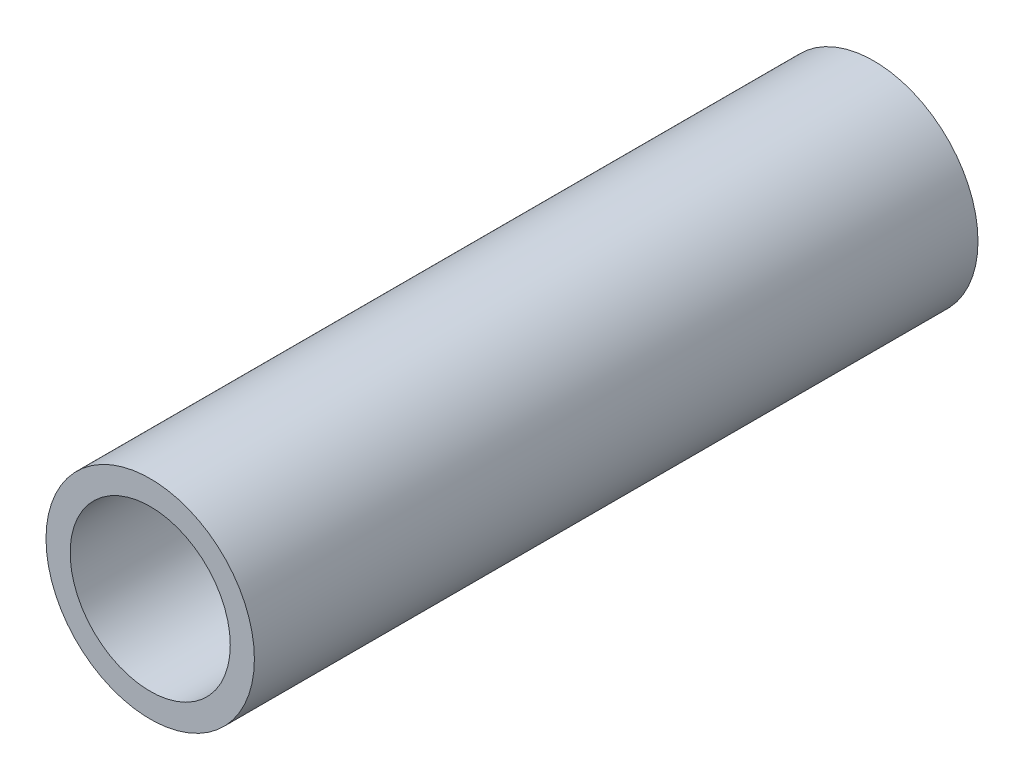
ISO-10303-21;
HEADER;
FILE_DESCRIPTION(('STEP AP214'),'2;1');
FILE_NAME('part.step','',(''),(''),'','','');
FILE_SCHEMA(('AUTOMOTIVE_DESIGN { 1 0 10303 214 1 1 1 1 }'));
ENDSEC;
DATA;
#1=APPLICATION_CONTEXT('core data for automotive mechanical design processes');
#2=APPLICATION_PROTOCOL_DEFINITION('international standard','automotive_design',2000,#1);
#3=PRODUCT_CONTEXT('',#1,'mechanical');
#4=PRODUCT('Part','Part','',(#3));
#5=PRODUCT_RELATED_PRODUCT_CATEGORY('part','',(#4));
#6=PRODUCT_DEFINITION_FORMATION('','',#4);
#7=PRODUCT_DEFINITION_CONTEXT('part definition',#1,'design');
#8=PRODUCT_DEFINITION('design','',#6,#7);
#9=PRODUCT_DEFINITION_SHAPE('','',#8);
#10=(LENGTH_UNIT() NAMED_UNIT(*) SI_UNIT(.MILLI.,.METRE.));
#11=(NAMED_UNIT(*) PLANE_ANGLE_UNIT() SI_UNIT($,.RADIAN.));
#12=(NAMED_UNIT(*) SI_UNIT($,.STERADIAN.) SOLID_ANGLE_UNIT());
#13=UNCERTAINTY_MEASURE_WITH_UNIT(LENGTH_MEASURE(1.E-05),#10,'distance_accuracy_value','');
#14=(GEOMETRIC_REPRESENTATION_CONTEXT(3) GLOBAL_UNCERTAINTY_ASSIGNED_CONTEXT((#13)) GLOBAL_UNIT_ASSIGNED_CONTEXT((#10,
#11,#12)) REPRESENTATION_CONTEXT('',''));
#15=CARTESIAN_POINT('',(0.,0.,0.));
#16=DIRECTION('',(0.,0.,1.));
#17=DIRECTION('',(1.,0.,0.));
#18=AXIS2_PLACEMENT_3D('',#15,#16,#17);
#19=CARTESIAN_POINT('',(0.,0.,150.));
#20=DIRECTION('',(0.,0.,1.));
#21=DIRECTION('',(1.,0.,0.));
#22=AXIS2_PLACEMENT_3D('',#19,#20,#21);
#23=PLANE('',#22);
#24=CARTESIAN_POINT('',(0.,0.,150.));
#25=DIRECTION('',(0.,0.,1.));
#26=DIRECTION('',(1.,0.,0.));
#27=AXIS2_PLACEMENT_3D('',#24,#25,#26);
#28=CIRCLE('',#27,21.6);
#29=CARTESIAN_POINT('',(21.6,0.,150.));
#30=VERTEX_POINT('',#29);
#31=EDGE_CURVE('E10',#30,#30,#28,.T.);
#32=ORIENTED_EDGE('',*,*,#31,.T.);
#33=EDGE_LOOP('',(#32));
#34=FACE_BOUND('',#33,.T.);
#35=CARTESIAN_POINT('',(0.,0.,150.));
#36=DIRECTION('',(0.,0.,1.));
#37=DIRECTION('',(1.,0.,0.));
#38=AXIS2_PLACEMENT_3D('',#35,#36,#37);
#39=CIRCLE('',#38,16.6);
#40=CARTESIAN_POINT('',(16.6,0.,150.));
#41=VERTEX_POINT('',#40);
#42=EDGE_CURVE('E42',#41,#41,#39,.T.);
#43=ORIENTED_EDGE('',*,*,#42,.F.);
#44=EDGE_LOOP('',(#43));
#45=FACE_BOUND('',#44,.T.);
#46=ADVANCED_FACE('F31',(#34,#45),#23,.T.);
#47=CARTESIAN_POINT('',(0.,0.,0.));
#48=DIRECTION('',(0.,0.,1.));
#49=DIRECTION('',(1.,0.,0.));
#50=AXIS2_PLACEMENT_3D('',#47,#48,#49);
#51=PLANE('',#50);
#52=CARTESIAN_POINT('',(0.,0.,0.));
#53=DIRECTION('',(0.,0.,1.));
#54=DIRECTION('',(1.,0.,0.));
#55=AXIS2_PLACEMENT_3D('',#52,#53,#54);
#56=CIRCLE('',#55,21.6);
#57=CARTESIAN_POINT('',(21.6,0.,0.));
#58=VERTEX_POINT('',#57);
#59=EDGE_CURVE('E35',#58,#58,#56,.T.);
#60=ORIENTED_EDGE('',*,*,#59,.F.);
#61=EDGE_LOOP('',(#60));
#62=FACE_BOUND('',#61,.T.);
#63=CARTESIAN_POINT('',(0.,0.,0.));
#64=DIRECTION('',(0.,0.,1.));
#65=DIRECTION('',(1.,0.,0.));
#66=AXIS2_PLACEMENT_3D('',#63,#64,#65);
#67=CIRCLE('',#66,16.6);
#68=CARTESIAN_POINT('',(16.6,0.,0.));
#69=VERTEX_POINT('',#68);
#70=EDGE_CURVE('E44',#69,#69,#67,.T.);
#71=ORIENTED_EDGE('',*,*,#70,.T.);
#72=EDGE_LOOP('',(#71));
#73=FACE_BOUND('',#72,.T.);
#74=ADVANCED_FACE('F54',(#62,#73),#51,.F.);
#75=CARTESIAN_POINT('',(0.,0.,150.));
#76=DIRECTION('',(0.,0.,-1.));
#77=DIRECTION('',(-1.,0.,0.));
#78=AXIS2_PLACEMENT_3D('',#75,#76,#77);
#79=CYLINDRICAL_SURFACE('',#78,21.6);
#80=ORIENTED_EDGE('',*,*,#31,.F.);
#81=EDGE_LOOP('',(#80));
#82=FACE_BOUND('',#81,.T.);
#83=ORIENTED_EDGE('',*,*,#59,.T.);
#84=EDGE_LOOP('',(#83));
#85=FACE_BOUND('',#84,.T.);
#86=ADVANCED_FACE('F33',(#82,#85),#79,.T.);
#87=CARTESIAN_POINT('',(0.,0.,150.));
#88=DIRECTION('',(0.,0.,-1.));
#89=DIRECTION('',(-1.,0.,0.));
#90=AXIS2_PLACEMENT_3D('',#87,#88,#89);
#91=CYLINDRICAL_SURFACE('',#90,16.6);
#92=ORIENTED_EDGE('',*,*,#42,.T.);
#93=EDGE_LOOP('',(#92));
#94=FACE_BOUND('',#93,.T.);
#95=ORIENTED_EDGE('',*,*,#70,.F.);
#96=EDGE_LOOP('',(#95));
#97=FACE_BOUND('',#96,.T.);
#98=ADVANCED_FACE('F50',(#94,#97),#91,.F.);
#99=CLOSED_SHELL('',(#46,#74,#86,#98));
#100=MANIFOLD_SOLID_BREP('B2',#99);
#101=ADVANCED_BREP_SHAPE_REPRESENTATION('',(#18,#100),#14);
#102=SHAPE_DEFINITION_REPRESENTATION(#9,#101);
ENDSEC;
END-ISO-10303-21;
